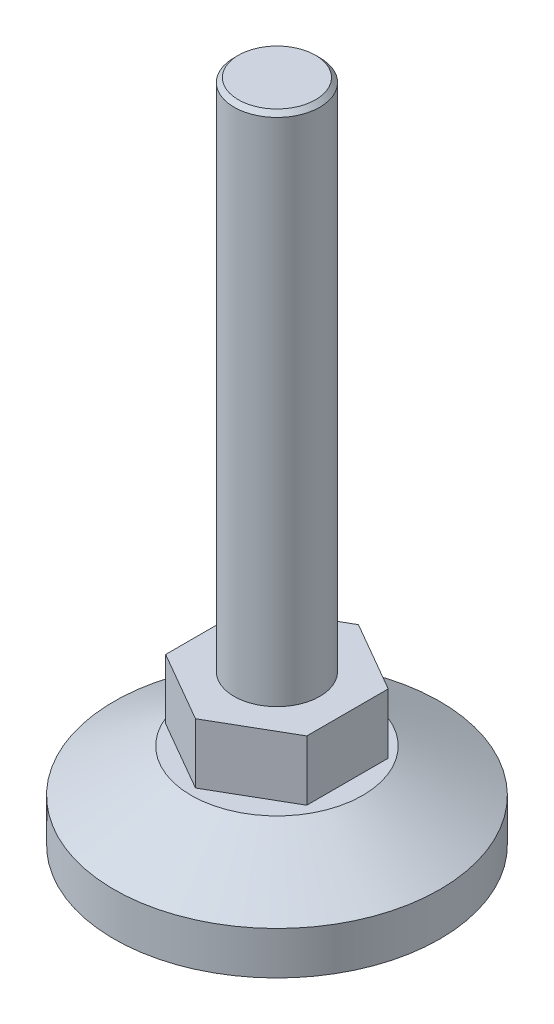
ISO-10303-21;
HEADER;
FILE_DESCRIPTION(('STEP AP214'),'2;1');
FILE_NAME('part.step','',(''),(''),'','','');
FILE_SCHEMA(('AUTOMOTIVE_DESIGN { 1 0 10303 214 1 1 1 1 }'));
ENDSEC;
DATA;
#1=APPLICATION_CONTEXT('core data for automotive mechanical design processes');
#2=APPLICATION_PROTOCOL_DEFINITION('international standard','automotive_design',2000,#1);
#3=PRODUCT_CONTEXT('',#1,'mechanical');
#4=PRODUCT('Part','Part','',(#3));
#5=PRODUCT_RELATED_PRODUCT_CATEGORY('part','',(#4));
#6=PRODUCT_DEFINITION_FORMATION('','',#4);
#7=PRODUCT_DEFINITION_CONTEXT('part definition',#1,'design');
#8=PRODUCT_DEFINITION('design','',#6,#7);
#9=PRODUCT_DEFINITION_SHAPE('','',#8);
#10=(LENGTH_UNIT() NAMED_UNIT(*) SI_UNIT(.MILLI.,.METRE.));
#11=(NAMED_UNIT(*) PLANE_ANGLE_UNIT() SI_UNIT($,.RADIAN.));
#12=(NAMED_UNIT(*) SI_UNIT($,.STERADIAN.) SOLID_ANGLE_UNIT());
#13=UNCERTAINTY_MEASURE_WITH_UNIT(LENGTH_MEASURE(1.E-05),#10,'distance_accuracy_value','');
#14=(GEOMETRIC_REPRESENTATION_CONTEXT(3) GLOBAL_UNCERTAINTY_ASSIGNED_CONTEXT((#13)) GLOBAL_UNIT_ASSIGNED_CONTEXT((#10,
#11,#12)) REPRESENTATION_CONTEXT('',''));
#15=CARTESIAN_POINT('',(0.,0.,0.));
#16=DIRECTION('',(0.,0.,1.));
#17=DIRECTION('',(1.,0.,0.));
#18=AXIS2_PLACEMENT_3D('',#15,#16,#17);
#19=CARTESIAN_POINT('',(-5.,17.5,0.));
#20=DIRECTION('',(0.,-1.,0.));
#21=DIRECTION('',(1.,0.,0.));
#22=AXIS2_PLACEMENT_3D('',#19,#20,#21);
#23=PLANE('',#22);
#24=CARTESIAN_POINT('',(0.,17.5,0.));
#25=DIRECTION('',(0.,-1.,0.));
#26=DIRECTION('',(1.,0.,0.));
#27=AXIS2_PLACEMENT_3D('',#24,#25,#26);
#28=CIRCLE('',#27,4.99999999999999);
#29=CARTESIAN_POINT('',(4.99999999999999,17.5,0.));
#30=VERTEX_POINT('',#29);
#31=EDGE_CURVE('E174',#30,#30,#28,.T.);
#32=ORIENTED_EDGE('',*,*,#31,.T.);
#33=EDGE_LOOP('',(#32));
#34=FACE_BOUND('',#33,.T.);
#35=DIRECTION('',(-0.866025403784442,0.,-0.499999999999995));
#36=VECTOR('',#35,1.);
#37=CARTESIAN_POINT('',(8.22724133595211,17.5,-4.7500000000001));
#38=LINE('',#37,#36);
#39=CARTESIAN_POINT('',(8.22724133595211,17.5,-4.7500000000001));
#40=VERTEX_POINT('',#39);
#41=CARTESIAN_POINT('',(0.,17.5,-9.5));
#42=VERTEX_POINT('',#41);
#43=EDGE_CURVE('E101',#40,#42,#38,.T.);
#44=ORIENTED_EDGE('',*,*,#43,.T.);
#45=DIRECTION('',(-0.866025403784438,0.,0.500000000000001));
#46=VECTOR('',#45,1.);
#47=CARTESIAN_POINT('',(0.,17.5,-9.5));
#48=LINE('',#47,#46);
#49=CARTESIAN_POINT('',(-8.22724133595218,17.5,-4.74999999999998));
#50=VERTEX_POINT('',#49);
#51=EDGE_CURVE('E134',#42,#50,#48,.T.);
#52=ORIENTED_EDGE('',*,*,#51,.T.);
#53=DIRECTION('',(0.,0.,1.));
#54=VECTOR('',#53,1.);
#55=CARTESIAN_POINT('',(-8.22724133595218,17.5,-4.74999999999998));
#56=LINE('',#55,#54);
#57=CARTESIAN_POINT('',(-8.22724133595215,17.5,4.75000000000003));
#58=VERTEX_POINT('',#57);
#59=EDGE_CURVE('E355',#50,#58,#56,.T.);
#60=ORIENTED_EDGE('',*,*,#59,.T.);
#61=DIRECTION('',(0.866025403784442,0.,0.499999999999995));
#62=VECTOR('',#61,1.);
#63=CARTESIAN_POINT('',(-8.22724133595215,17.5,4.75000000000004));
#64=LINE('',#63,#62);
#65=CARTESIAN_POINT('',(0.,17.5,9.5));
#66=VERTEX_POINT('',#65);
#67=EDGE_CURVE('E131',#58,#66,#64,.T.);
#68=ORIENTED_EDGE('',*,*,#67,.T.);
#69=DIRECTION('',(0.866025403784435,0.,-0.500000000000007));
#70=VECTOR('',#69,1.);
#71=CARTESIAN_POINT('',(0.,17.5,9.5));
#72=LINE('',#71,#70);
#73=CARTESIAN_POINT('',(8.22724133595221,17.5,4.74999999999992));
#74=VERTEX_POINT('',#73);
#75=EDGE_CURVE('E70',#66,#74,#72,.T.);
#76=ORIENTED_EDGE('',*,*,#75,.T.);
#77=DIRECTION('',(0.,0.,-1.));
#78=VECTOR('',#77,1.);
#79=CARTESIAN_POINT('',(8.22724133595221,17.5,4.74999999999992));
#80=LINE('',#79,#78);
#81=EDGE_CURVE('E107',#74,#40,#80,.T.);
#82=ORIENTED_EDGE('',*,*,#81,.T.);
#83=EDGE_LOOP('',(#44,#52,#60,#68,#76,#82));
#84=FACE_BOUND('',#83,.T.);
#85=ADVANCED_FACE('F45',(#34,#84),#23,.F.);
#86=CARTESIAN_POINT('',(-9.5,10.5,0.));
#87=DIRECTION('',(0.,1.,0.));
#88=DIRECTION('',(-1.,0.,0.));
#89=AXIS2_PLACEMENT_3D('',#86,#87,#88);
#90=PLANE('',#89);
#91=CARTESIAN_POINT('',(0.,10.5,0.));
#92=DIRECTION('',(0.,-1.,0.));
#93=DIRECTION('',(1.,0.,0.));
#94=AXIS2_PLACEMENT_3D('',#91,#92,#93);
#95=CIRCLE('',#94,5.);
#96=CARTESIAN_POINT('',(5.,10.5,0.));
#97=VERTEX_POINT('',#96);
#98=EDGE_CURVE('E170',#97,#97,#95,.T.);
#99=ORIENTED_EDGE('',*,*,#98,.F.);
#100=EDGE_LOOP('',(#99));
#101=FACE_BOUND('',#100,.T.);
#102=DIRECTION('',(0.866025403784442,0.,0.499999999999995));
#103=VECTOR('',#102,1.);
#104=CARTESIAN_POINT('',(8.22724133595211,10.5,-4.7500000000001));
#105=LINE('',#104,#103);
#106=CARTESIAN_POINT('',(0.,10.5,-9.5));
#107=VERTEX_POINT('',#106);
#108=CARTESIAN_POINT('',(8.22724133595211,10.5,-4.7500000000001));
#109=VERTEX_POINT('',#108);
#110=EDGE_CURVE('E62',#107,#109,#105,.T.);
#111=ORIENTED_EDGE('',*,*,#110,.T.);
#112=DIRECTION('',(0.,0.,1.));
#113=VECTOR('',#112,1.);
#114=CARTESIAN_POINT('',(8.22724133595221,10.5,4.74999999999992));
#115=LINE('',#114,#113);
#116=CARTESIAN_POINT('',(8.22724133595221,10.5,4.74999999999992));
#117=VERTEX_POINT('',#116);
#118=EDGE_CURVE('E115',#109,#117,#115,.T.);
#119=ORIENTED_EDGE('',*,*,#118,.T.);
#120=DIRECTION('',(-0.866025403784435,0.,0.500000000000007));
#121=VECTOR('',#120,1.);
#122=CARTESIAN_POINT('',(0.,10.5,9.5));
#123=LINE('',#122,#121);
#124=CARTESIAN_POINT('',(0.,10.5,9.5));
#125=VERTEX_POINT('',#124);
#126=EDGE_CURVE('E370',#117,#125,#123,.T.);
#127=ORIENTED_EDGE('',*,*,#126,.T.);
#128=DIRECTION('',(-0.866025403784442,0.,-0.499999999999995));
#129=VECTOR('',#128,1.);
#130=CARTESIAN_POINT('',(-8.22724133595215,10.5,4.75000000000004));
#131=LINE('',#130,#129);
#132=CARTESIAN_POINT('',(-8.22724133595215,10.5,4.75000000000003));
#133=VERTEX_POINT('',#132);
#134=EDGE_CURVE('E142',#125,#133,#131,.T.);
#135=ORIENTED_EDGE('',*,*,#134,.T.);
#136=DIRECTION('',(0.,0.,-1.));
#137=VECTOR('',#136,1.);
#138=CARTESIAN_POINT('',(-8.22724133595218,10.5,-4.74999999999998));
#139=LINE('',#138,#137);
#140=CARTESIAN_POINT('',(-8.22724133595218,10.5,-4.74999999999998));
#141=VERTEX_POINT('',#140);
#142=EDGE_CURVE('E357',#133,#141,#139,.T.);
#143=ORIENTED_EDGE('',*,*,#142,.T.);
#144=DIRECTION('',(0.866025403784438,0.,-0.500000000000001));
#145=VECTOR('',#144,1.);
#146=CARTESIAN_POINT('',(0.,10.5,-9.5));
#147=LINE('',#146,#145);
#148=EDGE_CURVE('E118',#141,#107,#147,.T.);
#149=ORIENTED_EDGE('',*,*,#148,.T.);
#150=EDGE_LOOP('',(#111,#119,#127,#135,#143,#149));
#151=FACE_BOUND('',#150,.T.);
#152=ADVANCED_FACE('F113',(#101,#151),#90,.F.);
#153=CARTESIAN_POINT('',(0.,77.5,0.));
#154=DIRECTION('',(0.,-1.,0.));
#155=DIRECTION('',(1.,0.,0.));
#156=AXIS2_PLACEMENT_3D('',#153,#154,#155);
#157=PLANE('',#156);
#158=CARTESIAN_POINT('',(0.,77.5,0.));
#159=DIRECTION('',(0.,-1.,0.));
#160=DIRECTION('',(1.,0.,0.));
#161=AXIS2_PLACEMENT_3D('',#158,#159,#160);
#162=CIRCLE('',#161,4.50000000000001);
#163=CARTESIAN_POINT('',(4.5,77.5,0.));
#164=VERTEX_POINT('',#163);
#165=EDGE_CURVE('E11',#164,#164,#162,.F.);
#166=ORIENTED_EDGE('',*,*,#165,.T.);
#167=EDGE_LOOP('',(#166));
#168=FACE_BOUND('',#167,.T.);
#169=ADVANCED_FACE('F203',(#168),#157,.F.);
#170=CARTESIAN_POINT('',(0.,0.,0.));
#171=DIRECTION('',(0.,-1.,0.));
#172=DIRECTION('',(1.,0.,0.));
#173=AXIS2_PLACEMENT_3D('',#170,#171,#172);
#174=CYLINDRICAL_SURFACE('',#173,5.);
#175=CARTESIAN_POINT('',(0.,77.,0.));
#176=DIRECTION('',(0.,-1.,0.));
#177=DIRECTION('',(1.,0.,0.));
#178=AXIS2_PLACEMENT_3D('',#175,#176,#177);
#179=CIRCLE('',#178,5.);
#180=CARTESIAN_POINT('',(4.99999999999999,77.,0.));
#181=VERTEX_POINT('',#180);
#182=EDGE_CURVE('E55',#181,#181,#179,.T.);
#183=ORIENTED_EDGE('',*,*,#182,.T.);
#184=EDGE_LOOP('',(#183));
#185=FACE_BOUND('',#184,.T.);
#186=ORIENTED_EDGE('',*,*,#31,.F.);
#187=EDGE_LOOP('',(#186));
#188=FACE_BOUND('',#187,.T.);
#189=ADVANCED_FACE('F181',(#185,#188),#174,.T.);
#190=CARTESIAN_POINT('',(0.,0.,0.));
#191=DIRECTION('',(0.,-1.,0.));
#192=DIRECTION('',(1.,0.,0.));
#193=AXIS2_PLACEMENT_3D('',#190,#191,#192);
#194=CYLINDRICAL_SURFACE('',#193,5.);
#195=CARTESIAN_POINT('',(0.,10.,0.));
#196=DIRECTION('',(0.,-1.,0.));
#197=DIRECTION('',(1.,0.,0.));
#198=AXIS2_PLACEMENT_3D('',#195,#196,#197);
#199=CIRCLE('',#198,5.);
#200=CARTESIAN_POINT('',(5.,10.,0.));
#201=VERTEX_POINT('',#200);
#202=EDGE_CURVE('E166',#201,#201,#199,.T.);
#203=ORIENTED_EDGE('',*,*,#202,.F.);
#204=EDGE_LOOP('',(#203));
#205=FACE_BOUND('',#204,.T.);
#206=ORIENTED_EDGE('',*,*,#98,.T.);
#207=EDGE_LOOP('',(#206));
#208=FACE_BOUND('',#207,.T.);
#209=ADVANCED_FACE('F210',(#205,#208),#194,.T.);
#210=CARTESIAN_POINT('',(-5.,10.,0.));
#211=DIRECTION('',(0.,-1.,0.));
#212=DIRECTION('',(1.,0.,0.));
#213=AXIS2_PLACEMENT_3D('',#210,#211,#212);
#214=PLANE('',#213);
#215=CARTESIAN_POINT('',(0.,10.,0.));
#216=DIRECTION('',(0.,-1.,0.));
#217=DIRECTION('',(1.,0.,0.));
#218=AXIS2_PLACEMENT_3D('',#215,#216,#217);
#219=CIRCLE('',#218,10.);
#220=CARTESIAN_POINT('',(10.,10.,0.));
#221=VERTEX_POINT('',#220);
#222=EDGE_CURVE('E162',#221,#221,#219,.T.);
#223=ORIENTED_EDGE('',*,*,#222,.F.);
#224=EDGE_LOOP('',(#223));
#225=FACE_BOUND('',#224,.T.);
#226=ORIENTED_EDGE('',*,*,#202,.T.);
#227=EDGE_LOOP('',(#226));
#228=FACE_BOUND('',#227,.T.);
#229=ADVANCED_FACE('F227',(#225,#228),#214,.F.);
#230=CARTESIAN_POINT('',(0.,10.,0.));
#231=DIRECTION('',(0.,-1.,0.));
#232=DIRECTION('',(1.,0.,0.));
#233=AXIS2_PLACEMENT_3D('',#230,#231,#232);
#234=CONICAL_SURFACE('',#233,10.,1.06369782240256);
#235=CARTESIAN_POINT('',(0.,5.,0.));
#236=DIRECTION('',(0.,-1.,0.));
#237=DIRECTION('',(1.,0.,0.));
#238=AXIS2_PLACEMENT_3D('',#235,#236,#237);
#239=CIRCLE('',#238,19.);
#240=CARTESIAN_POINT('',(19.,5.00000000000001,0.));
#241=VERTEX_POINT('',#240);
#242=EDGE_CURVE('E158',#241,#241,#239,.T.);
#243=ORIENTED_EDGE('',*,*,#242,.F.);
#244=EDGE_LOOP('',(#243));
#245=FACE_BOUND('',#244,.T.);
#246=ORIENTED_EDGE('',*,*,#222,.T.);
#247=EDGE_LOOP('',(#246));
#248=FACE_BOUND('',#247,.T.);
#249=ADVANCED_FACE('F234',(#245,#248),#234,.T.);
#250=CARTESIAN_POINT('',(0.,0.,0.));
#251=DIRECTION('',(0.,-1.,0.));
#252=DIRECTION('',(1.,0.,0.));
#253=AXIS2_PLACEMENT_3D('',#250,#251,#252);
#254=CYLINDRICAL_SURFACE('',#253,19.);
#255=CARTESIAN_POINT('',(0.,0.,0.));
#256=DIRECTION('',(0.,-1.,0.));
#257=DIRECTION('',(1.,0.,0.));
#258=AXIS2_PLACEMENT_3D('',#255,#256,#257);
#259=CIRCLE('',#258,19.);
#260=CARTESIAN_POINT('',(19.,0.,0.));
#261=VERTEX_POINT('',#260);
#262=EDGE_CURVE('E154',#261,#261,#259,.T.);
#263=ORIENTED_EDGE('',*,*,#262,.F.);
#264=EDGE_LOOP('',(#263));
#265=FACE_BOUND('',#264,.T.);
#266=ORIENTED_EDGE('',*,*,#242,.T.);
#267=EDGE_LOOP('',(#266));
#268=FACE_BOUND('',#267,.T.);
#269=ADVANCED_FACE('F242',(#265,#268),#254,.T.);
#270=CARTESIAN_POINT('',(-19.,0.,0.));
#271=DIRECTION('',(0.,1.,0.));
#272=DIRECTION('',(-1.,0.,0.));
#273=AXIS2_PLACEMENT_3D('',#270,#271,#272);
#274=PLANE('',#273);
#275=CARTESIAN_POINT('',(0.,0.,0.));
#276=DIRECTION('',(0.,-1.,0.));
#277=DIRECTION('',(1.,0.,0.));
#278=AXIS2_PLACEMENT_3D('',#275,#276,#277);
#279=CIRCLE('',#278,5.);
#280=CARTESIAN_POINT('',(5.,0.,0.));
#281=VERTEX_POINT('',#280);
#282=EDGE_CURVE('E150',#281,#281,#279,.T.);
#283=ORIENTED_EDGE('',*,*,#282,.F.);
#284=EDGE_LOOP('',(#283));
#285=FACE_BOUND('',#284,.T.);
#286=ORIENTED_EDGE('',*,*,#262,.T.);
#287=EDGE_LOOP('',(#286));
#288=FACE_BOUND('',#287,.T.);
#289=ADVANCED_FACE('F250',(#285,#288),#274,.F.);
#290=CARTESIAN_POINT('',(0.,0.,0.));
#291=DIRECTION('',(0.,-1.,0.));
#292=DIRECTION('',(1.,0.,0.));
#293=AXIS2_PLACEMENT_3D('',#290,#291,#292);
#294=CYLINDRICAL_SURFACE('',#293,5.);
#295=CARTESIAN_POINT('',(0.,7.,0.));
#296=DIRECTION('',(0.,-1.,0.));
#297=DIRECTION('',(1.,0.,0.));
#298=AXIS2_PLACEMENT_3D('',#295,#296,#297);
#299=CIRCLE('',#298,5.);
#300=CARTESIAN_POINT('',(5.,7.,0.));
#301=VERTEX_POINT('',#300);
#302=EDGE_CURVE('E139',#301,#301,#299,.T.);
#303=ORIENTED_EDGE('',*,*,#302,.F.);
#304=EDGE_LOOP('',(#303));
#305=FACE_BOUND('',#304,.T.);
#306=ORIENTED_EDGE('',*,*,#282,.T.);
#307=EDGE_LOOP('',(#306));
#308=FACE_BOUND('',#307,.T.);
#309=ADVANCED_FACE('F193',(#305,#308),#294,.F.);
#310=CARTESIAN_POINT('',(0.,7.,0.));
#311=DIRECTION('',(0.,1.,0.));
#312=DIRECTION('',(-1.,0.,0.));
#313=AXIS2_PLACEMENT_3D('',#310,#311,#312);
#314=PLANE('',#313);
#315=ORIENTED_EDGE('',*,*,#302,.T.);
#316=EDGE_LOOP('',(#315));
#317=FACE_BOUND('',#316,.T.);
#318=ADVANCED_FACE('F185',(#317),#314,.F.);
#319=CARTESIAN_POINT('',(0.,77.,0.));
#320=DIRECTION('',(0.,-1.,0.));
#321=DIRECTION('',(1.,0.,0.));
#322=AXIS2_PLACEMENT_3D('',#319,#320,#321);
#323=CONICAL_SURFACE('',#322,5.,0.785398163397435);
#324=ORIENTED_EDGE('',*,*,#165,.F.);
#325=EDGE_LOOP('',(#324));
#326=FACE_BOUND('',#325,.T.);
#327=ORIENTED_EDGE('',*,*,#182,.F.);
#328=EDGE_LOOP('',(#327));
#329=FACE_BOUND('',#328,.T.);
#330=ADVANCED_FACE('F48',(#326,#329),#323,.T.);
#331=CARTESIAN_POINT('',(8.22724133595221,-0.00100000000000447,4.74999999999992));
#332=DIRECTION('',(1.,0.,0.));
#333=DIRECTION('',(0.,0.,-1.));
#334=AXIS2_PLACEMENT_3D('',#331,#332,#333);
#335=PLANE('',#334);
#336=DIRECTION('',(0.,-1.,0.));
#337=VECTOR('',#336,1.);
#338=CARTESIAN_POINT('',(8.22724133595211,0.,-4.75000000000009));
#339=LINE('',#338,#337);
#340=EDGE_CURVE('E98',#40,#109,#339,.T.);
#341=ORIENTED_EDGE('',*,*,#340,.F.);
#342=ORIENTED_EDGE('',*,*,#81,.F.);
#343=DIRECTION('',(0.,-1.,0.));
#344=VECTOR('',#343,1.);
#345=CARTESIAN_POINT('',(8.22724133595221,0.,4.74999999999992));
#346=LINE('',#345,#344);
#347=EDGE_CURVE('E108',#74,#117,#346,.T.);
#348=ORIENTED_EDGE('',*,*,#347,.T.);
#349=ORIENTED_EDGE('',*,*,#118,.F.);
#350=EDGE_LOOP('',(#341,#342,#348,#349));
#351=FACE_BOUND('',#350,.T.);
#352=ADVANCED_FACE('F123',(#351),#335,.T.);
#353=CARTESIAN_POINT('',(-8.22724133595214,-0.00100000000000447,4.75000000000004));
#354=DIRECTION('',(-0.499999999999995,0.,0.866025403784442));
#355=DIRECTION('',(0.866025403784442,0.,0.499999999999995));
#356=AXIS2_PLACEMENT_3D('',#353,#354,#355);
#357=PLANE('',#356);
#358=DIRECTION('',(0.,-1.,0.));
#359=VECTOR('',#358,1.);
#360=CARTESIAN_POINT('',(0.,0.,9.5));
#361=LINE('',#360,#359);
#362=EDGE_CURVE('E365',#66,#125,#361,.T.);
#363=ORIENTED_EDGE('',*,*,#362,.F.);
#364=ORIENTED_EDGE('',*,*,#67,.F.);
#365=DIRECTION('',(0.,-1.,0.));
#366=VECTOR('',#365,1.);
#367=CARTESIAN_POINT('',(-8.22724133595215,0.,4.75000000000003));
#368=LINE('',#367,#366);
#369=EDGE_CURVE('E125',#58,#133,#368,.T.);
#370=ORIENTED_EDGE('',*,*,#369,.T.);
#371=ORIENTED_EDGE('',*,*,#134,.F.);
#372=EDGE_LOOP('',(#363,#364,#370,#371));
#373=FACE_BOUND('',#372,.T.);
#374=ADVANCED_FACE('F191',(#373),#357,.T.);
#375=CARTESIAN_POINT('',(0.,-0.00100000000000447,-9.5));
#376=DIRECTION('',(-0.500000000000001,0.,-0.866025403784438));
#377=DIRECTION('',(-0.866025403784438,0.,0.500000000000001));
#378=AXIS2_PLACEMENT_3D('',#375,#376,#377);
#379=PLANE('',#378);
#380=DIRECTION('',(0.,1.,0.));
#381=VECTOR('',#380,1.);
#382=CARTESIAN_POINT('',(-8.22724133595218,-0.00100000000000447,-4.74999999999998));
#383=LINE('',#382,#381);
#384=EDGE_CURVE('E363',#141,#50,#383,.T.);
#385=ORIENTED_EDGE('',*,*,#384,.T.);
#386=ORIENTED_EDGE('',*,*,#51,.F.);
#387=DIRECTION('',(0.,1.,0.));
#388=VECTOR('',#387,1.);
#389=CARTESIAN_POINT('',(0.,-0.00100000000000447,-9.5));
#390=LINE('',#389,#388);
#391=EDGE_CURVE('E120',#107,#42,#390,.T.);
#392=ORIENTED_EDGE('',*,*,#391,.F.);
#393=ORIENTED_EDGE('',*,*,#148,.F.);
#394=EDGE_LOOP('',(#385,#386,#392,#393));
#395=FACE_BOUND('',#394,.T.);
#396=ADVANCED_FACE('F313',(#395),#379,.T.);
#397=CARTESIAN_POINT('',(0.,-0.00100000000000447,9.5));
#398=DIRECTION('',(0.500000000000007,0.,0.866025403784435));
#399=DIRECTION('',(0.866025403784435,0.,-0.500000000000007));
#400=AXIS2_PLACEMENT_3D('',#397,#398,#399);
#401=PLANE('',#400);
#402=ORIENTED_EDGE('',*,*,#347,.F.);
#403=ORIENTED_EDGE('',*,*,#75,.F.);
#404=ORIENTED_EDGE('',*,*,#362,.T.);
#405=ORIENTED_EDGE('',*,*,#126,.F.);
#406=EDGE_LOOP('',(#402,#403,#404,#405));
#407=FACE_BOUND('',#406,.T.);
#408=ADVANCED_FACE('F323',(#407),#401,.T.);
#409=CARTESIAN_POINT('',(-8.22724133595218,-0.00100000000000447,-4.74999999999998));
#410=DIRECTION('',(-1.,0.,0.));
#411=DIRECTION('',(0.,0.,1.));
#412=AXIS2_PLACEMENT_3D('',#409,#410,#411);
#413=PLANE('',#412);
#414=ORIENTED_EDGE('',*,*,#369,.F.);
#415=ORIENTED_EDGE('',*,*,#59,.F.);
#416=ORIENTED_EDGE('',*,*,#384,.F.);
#417=ORIENTED_EDGE('',*,*,#142,.F.);
#418=EDGE_LOOP('',(#414,#415,#416,#417));
#419=FACE_BOUND('',#418,.T.);
#420=ADVANCED_FACE('F333',(#419),#413,.T.);
#421=CARTESIAN_POINT('',(8.22724133595211,-0.00100000000000447,-4.7500000000001));
#422=DIRECTION('',(0.499999999999995,0.,-0.866025403784441));
#423=DIRECTION('',(-0.866025403784442,0.,-0.499999999999995));
#424=AXIS2_PLACEMENT_3D('',#421,#422,#423);
#425=PLANE('',#424);
#426=ORIENTED_EDGE('',*,*,#391,.T.);
#427=ORIENTED_EDGE('',*,*,#43,.F.);
#428=ORIENTED_EDGE('',*,*,#340,.T.);
#429=ORIENTED_EDGE('',*,*,#110,.F.);
#430=EDGE_LOOP('',(#426,#427,#428,#429));
#431=FACE_BOUND('',#430,.T.);
#432=ADVANCED_FACE('F99',(#431),#425,.T.);
#433=CLOSED_SHELL('',(#85,#152,#169,#189,#209,#229,#249,#269,#289,#309,#318,#330,#352,#374,#396,
#408,#420,#432));
#434=MANIFOLD_SOLID_BREP('B2',#433);
#435=ADVANCED_BREP_SHAPE_REPRESENTATION('',(#18,#434),#14);
#436=SHAPE_DEFINITION_REPRESENTATION(#9,#435);
ENDSEC;
END-ISO-10303-21;
